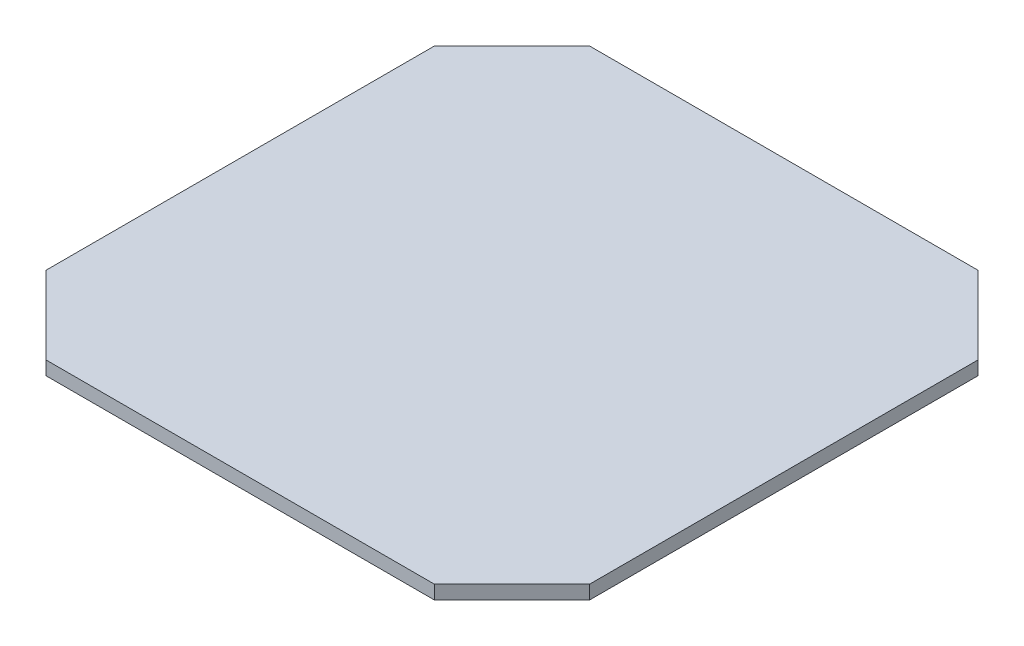
ISO-10303-21;
HEADER;
FILE_DESCRIPTION(('STEP AP214'),'2;1');
FILE_NAME('part.step','',(''),(''),'','','');
FILE_SCHEMA(('AUTOMOTIVE_DESIGN { 1 0 10303 214 1 1 1 1 }'));
ENDSEC;
DATA;
#1=APPLICATION_CONTEXT('core data for automotive mechanical design processes');
#2=APPLICATION_PROTOCOL_DEFINITION('international standard','automotive_design',2000,#1);
#3=PRODUCT_CONTEXT('',#1,'mechanical');
#4=PRODUCT('Part','Part','',(#3));
#5=PRODUCT_RELATED_PRODUCT_CATEGORY('part','',(#4));
#6=PRODUCT_DEFINITION_FORMATION('','',#4);
#7=PRODUCT_DEFINITION_CONTEXT('part definition',#1,'design');
#8=PRODUCT_DEFINITION('design','',#6,#7);
#9=PRODUCT_DEFINITION_SHAPE('','',#8);
#10=(LENGTH_UNIT() NAMED_UNIT(*) SI_UNIT(.MILLI.,.METRE.));
#11=(NAMED_UNIT(*) PLANE_ANGLE_UNIT() SI_UNIT($,.RADIAN.));
#12=(NAMED_UNIT(*) SI_UNIT($,.STERADIAN.) SOLID_ANGLE_UNIT());
#13=UNCERTAINTY_MEASURE_WITH_UNIT(LENGTH_MEASURE(1.E-05),#10,'distance_accuracy_value','');
#14=(GEOMETRIC_REPRESENTATION_CONTEXT(3) GLOBAL_UNCERTAINTY_ASSIGNED_CONTEXT((#13)) GLOBAL_UNIT_ASSIGNED_CONTEXT((#10,
#11,#12)) REPRESENTATION_CONTEXT('',''));
#15=CARTESIAN_POINT('',(0.,0.,0.));
#16=DIRECTION('',(0.,0.,1.));
#17=DIRECTION('',(1.,0.,0.));
#18=AXIS2_PLACEMENT_3D('',#15,#16,#17);
#19=CARTESIAN_POINT('',(-62.8617928474846,3.175,44.9012806053457));
#20=DIRECTION('',(1.,0.,0.));
#21=DIRECTION('',(0.,0.,-1.));
#22=AXIS2_PLACEMENT_3D('',#19,#20,#21);
#23=PLANE('',#22);
#24=DIRECTION('',(0.,0.,1.));
#25=VECTOR('',#24,1.);
#26=CARTESIAN_POINT('',(-62.8617928474846,0.,44.9012806053457));
#27=LINE('',#26,#25);
#28=CARTESIAN_POINT('',(-62.8617928474846,0.,-44.9012806053459));
#29=VERTEX_POINT('',#28);
#30=CARTESIAN_POINT('',(-62.8617928474846,0.,44.9012806053457));
#31=VERTEX_POINT('',#30);
#32=EDGE_CURVE('E129',#29,#31,#27,.T.);
#33=ORIENTED_EDGE('',*,*,#32,.T.);
#34=DIRECTION('',(0.,-1.,0.));
#35=VECTOR('',#34,1.);
#36=CARTESIAN_POINT('',(-62.8617928474846,3.175,44.9012806053457));
#37=LINE('',#36,#35);
#38=CARTESIAN_POINT('',(-62.8617928474846,3.175,44.9012806053457));
#39=VERTEX_POINT('',#38);
#40=EDGE_CURVE('E11',#39,#31,#37,.T.);
#41=ORIENTED_EDGE('',*,*,#40,.F.);
#42=DIRECTION('',(0.,0.,1.));
#43=VECTOR('',#42,1.);
#44=CARTESIAN_POINT('',(-62.8617928474846,3.175,44.9012806053457));
#45=LINE('',#44,#43);
#46=CARTESIAN_POINT('',(-62.8617928474846,3.175,-44.9012806053459));
#47=VERTEX_POINT('',#46);
#48=EDGE_CURVE('E143',#47,#39,#45,.T.);
#49=ORIENTED_EDGE('',*,*,#48,.F.);
#50=DIRECTION('',(0.,-1.,0.));
#51=VECTOR('',#50,1.);
#52=CARTESIAN_POINT('',(-62.8617928474846,3.175,-44.9012806053459));
#53=LINE('',#52,#51);
#54=EDGE_CURVE('E125',#47,#29,#53,.T.);
#55=ORIENTED_EDGE('',*,*,#54,.T.);
#56=EDGE_LOOP('',(#33,#41,#49,#55));
#57=FACE_BOUND('',#56,.T.);
#58=ADVANCED_FACE('F33',(#57),#23,.F.);
#59=CARTESIAN_POINT('',(-62.8617928474846,3.175,44.9012806053457));
#60=DIRECTION('',(0.707106781186551,0.,-0.707106781186544));
#61=DIRECTION('',(-0.707106781186544,0.,-0.707106781186551));
#62=AXIS2_PLACEMENT_3D('',#59,#60,#61);
#63=PLANE('',#62);
#64=DIRECTION('',(0.707106781186544,0.,0.707106781186551));
#65=VECTOR('',#64,1.);
#66=CARTESIAN_POINT('',(-62.8617928474846,0.,44.9012806053457));
#67=LINE('',#66,#65);
#68=CARTESIAN_POINT('',(-44.9012806053463,0.,62.8617928474841));
#69=VERTEX_POINT('',#68);
#70=EDGE_CURVE('E132',#31,#69,#67,.T.);
#71=ORIENTED_EDGE('',*,*,#70,.T.);
#72=DIRECTION('',(0.,-1.,0.));
#73=VECTOR('',#72,1.);
#74=CARTESIAN_POINT('',(-44.9012806053463,3.175,62.8617928474841));
#75=LINE('',#74,#73);
#76=CARTESIAN_POINT('',(-44.9012806053463,3.175,62.8617928474841));
#77=VERTEX_POINT('',#76);
#78=EDGE_CURVE('E41',#77,#69,#75,.T.);
#79=ORIENTED_EDGE('',*,*,#78,.F.);
#80=DIRECTION('',(0.707106781186544,0.,0.707106781186551));
#81=VECTOR('',#80,1.);
#82=CARTESIAN_POINT('',(-62.8617928474846,3.175,44.9012806053457));
#83=LINE('',#82,#81);
#84=EDGE_CURVE('E92',#39,#77,#83,.T.);
#85=ORIENTED_EDGE('',*,*,#84,.F.);
#86=ORIENTED_EDGE('',*,*,#40,.T.);
#87=EDGE_LOOP('',(#71,#79,#85,#86));
#88=FACE_BOUND('',#87,.T.);
#89=ADVANCED_FACE('F178',(#88),#63,.F.);
#90=CARTESIAN_POINT('',(-44.9012806053463,3.175,62.8617928474841));
#91=DIRECTION('',(0.,0.,-1.));
#92=DIRECTION('',(-1.,0.,0.));
#93=AXIS2_PLACEMENT_3D('',#90,#91,#92);
#94=PLANE('',#93);
#95=DIRECTION('',(1.,0.,0.));
#96=VECTOR('',#95,1.);
#97=CARTESIAN_POINT('',(-44.9012806053463,0.,62.8617928474841));
#98=LINE('',#97,#96);
#99=CARTESIAN_POINT('',(44.9012806053452,0.,62.8617928474841));
#100=VERTEX_POINT('',#99);
#101=EDGE_CURVE('E134',#69,#100,#98,.T.);
#102=ORIENTED_EDGE('',*,*,#101,.T.);
#103=DIRECTION('',(0.,-1.,0.));
#104=VECTOR('',#103,1.);
#105=CARTESIAN_POINT('',(44.9012806053452,3.175,62.8617928474841));
#106=LINE('',#105,#104);
#107=CARTESIAN_POINT('',(44.9012806053452,3.175,62.8617928474841));
#108=VERTEX_POINT('',#107);
#109=EDGE_CURVE('E150',#108,#100,#106,.T.);
#110=ORIENTED_EDGE('',*,*,#109,.F.);
#111=DIRECTION('',(1.,0.,0.));
#112=VECTOR('',#111,1.);
#113=CARTESIAN_POINT('',(-44.9012806053463,3.175,62.8617928474841));
#114=LINE('',#113,#112);
#115=EDGE_CURVE('E158',#77,#108,#114,.T.);
#116=ORIENTED_EDGE('',*,*,#115,.F.);
#117=ORIENTED_EDGE('',*,*,#78,.T.);
#118=EDGE_LOOP('',(#102,#110,#116,#117));
#119=FACE_BOUND('',#118,.T.);
#120=ADVANCED_FACE('F156',(#119),#94,.F.);
#121=CARTESIAN_POINT('',(44.9012806053452,3.175,62.8617928474841));
#122=DIRECTION('',(-0.707106781186543,0.,-0.707106781186551));
#123=DIRECTION('',(-0.707106781186551,0.,0.707106781186544));
#124=AXIS2_PLACEMENT_3D('',#121,#122,#123);
#125=PLANE('',#124);
#126=DIRECTION('',(0.707106781186552,0.,-0.707106781186544));
#127=VECTOR('',#126,1.);
#128=CARTESIAN_POINT('',(44.9012806053452,0.,62.8617928474841));
#129=LINE('',#128,#127);
#130=CARTESIAN_POINT('',(62.8617928474836,0.,44.9012806053459));
#131=VERTEX_POINT('',#130);
#132=EDGE_CURVE('E136',#100,#131,#129,.T.);
#133=ORIENTED_EDGE('',*,*,#132,.T.);
#134=DIRECTION('',(0.,-1.,0.));
#135=VECTOR('',#134,1.);
#136=CARTESIAN_POINT('',(62.8617928474836,3.175,44.9012806053459));
#137=LINE('',#136,#135);
#138=CARTESIAN_POINT('',(62.8617928474836,3.175,44.9012806053459));
#139=VERTEX_POINT('',#138);
#140=EDGE_CURVE('E147',#139,#131,#137,.T.);
#141=ORIENTED_EDGE('',*,*,#140,.F.);
#142=DIRECTION('',(0.707106781186552,0.,-0.707106781186544));
#143=VECTOR('',#142,1.);
#144=CARTESIAN_POINT('',(44.9012806053452,3.175,62.8617928474841));
#145=LINE('',#144,#143);
#146=EDGE_CURVE('E170',#108,#139,#145,.T.);
#147=ORIENTED_EDGE('',*,*,#146,.F.);
#148=ORIENTED_EDGE('',*,*,#109,.T.);
#149=EDGE_LOOP('',(#133,#141,#147,#148));
#150=FACE_BOUND('',#149,.T.);
#151=ADVANCED_FACE('F166',(#150),#125,.F.);
#152=CARTESIAN_POINT('',(62.8617928474836,3.175,44.9012806053459));
#153=DIRECTION('',(-1.,0.,0.));
#154=DIRECTION('',(0.,0.,1.));
#155=AXIS2_PLACEMENT_3D('',#152,#153,#154);
#156=PLANE('',#155);
#157=DIRECTION('',(0.,0.,-1.));
#158=VECTOR('',#157,1.);
#159=CARTESIAN_POINT('',(62.8617928474836,0.,44.9012806053459));
#160=LINE('',#159,#158);
#161=CARTESIAN_POINT('',(62.8617928474836,0.,-44.9012806053457));
#162=VERTEX_POINT('',#161);
#163=EDGE_CURVE('E138',#131,#162,#160,.T.);
#164=ORIENTED_EDGE('',*,*,#163,.T.);
#165=DIRECTION('',(0.,-1.,0.));
#166=VECTOR('',#165,1.);
#167=CARTESIAN_POINT('',(62.8617928474836,3.175,-44.9012806053457));
#168=LINE('',#167,#166);
#169=CARTESIAN_POINT('',(62.8617928474836,3.175,-44.9012806053457));
#170=VERTEX_POINT('',#169);
#171=EDGE_CURVE('E120',#170,#162,#168,.T.);
#172=ORIENTED_EDGE('',*,*,#171,.F.);
#173=DIRECTION('',(0.,0.,-1.));
#174=VECTOR('',#173,1.);
#175=CARTESIAN_POINT('',(62.8617928474836,3.175,44.9012806053459));
#176=LINE('',#175,#174);
#177=EDGE_CURVE('E111',#139,#170,#176,.T.);
#178=ORIENTED_EDGE('',*,*,#177,.F.);
#179=ORIENTED_EDGE('',*,*,#140,.T.);
#180=EDGE_LOOP('',(#164,#172,#178,#179));
#181=FACE_BOUND('',#180,.T.);
#182=ADVANCED_FACE('F169',(#181),#156,.F.);
#183=CARTESIAN_POINT('',(62.8617928474836,3.175,-44.9012806053457));
#184=DIRECTION('',(-0.707106781186551,0.,0.707106781186544));
#185=DIRECTION('',(0.707106781186544,0.,0.707106781186551));
#186=AXIS2_PLACEMENT_3D('',#183,#184,#185);
#187=PLANE('',#186);
#188=DIRECTION('',(-0.707106781186544,0.,-0.707106781186551));
#189=VECTOR('',#188,1.);
#190=CARTESIAN_POINT('',(62.8617928474836,0.,-44.9012806053457));
#191=LINE('',#190,#189);
#192=CARTESIAN_POINT('',(44.9012806053454,0.,-62.8617928474841));
#193=VERTEX_POINT('',#192);
#194=EDGE_CURVE('E119',#162,#193,#191,.T.);
#195=ORIENTED_EDGE('',*,*,#194,.T.);
#196=DIRECTION('',(0.,-1.,0.));
#197=VECTOR('',#196,1.);
#198=CARTESIAN_POINT('',(44.9012806053454,3.175,-62.8617928474841));
#199=LINE('',#198,#197);
#200=CARTESIAN_POINT('',(44.9012806053454,3.175,-62.8617928474841));
#201=VERTEX_POINT('',#200);
#202=EDGE_CURVE('E116',#201,#193,#199,.T.);
#203=ORIENTED_EDGE('',*,*,#202,.F.);
#204=DIRECTION('',(-0.707106781186544,0.,-0.707106781186551));
#205=VECTOR('',#204,1.);
#206=CARTESIAN_POINT('',(62.8617928474836,3.175,-44.9012806053457));
#207=LINE('',#206,#205);
#208=EDGE_CURVE('E105',#170,#201,#207,.T.);
#209=ORIENTED_EDGE('',*,*,#208,.F.);
#210=ORIENTED_EDGE('',*,*,#171,.T.);
#211=EDGE_LOOP('',(#195,#203,#209,#210));
#212=FACE_BOUND('',#211,.T.);
#213=ADVANCED_FACE('F117',(#212),#187,.F.);
#214=CARTESIAN_POINT('',(-44.9012806053462,3.175,-62.8617928474841));
#215=DIRECTION('',(0.,0.,1.));
#216=DIRECTION('',(1.,0.,0.));
#217=AXIS2_PLACEMENT_3D('',#214,#215,#216);
#218=PLANE('',#217);
#219=DIRECTION('',(-1.,0.,0.));
#220=VECTOR('',#219,1.);
#221=CARTESIAN_POINT('',(-44.9012806053462,0.,-62.8617928474841));
#222=LINE('',#221,#220);
#223=CARTESIAN_POINT('',(-44.9012806053462,0.,-62.8617928474841));
#224=VERTEX_POINT('',#223);
#225=EDGE_CURVE('E78',#193,#224,#222,.T.);
#226=ORIENTED_EDGE('',*,*,#225,.T.);
#227=DIRECTION('',(0.,-1.,0.));
#228=VECTOR('',#227,1.);
#229=CARTESIAN_POINT('',(-44.9012806053462,3.175,-62.8617928474841));
#230=LINE('',#229,#228);
#231=CARTESIAN_POINT('',(-44.9012806053462,3.175,-62.8617928474841));
#232=VERTEX_POINT('',#231);
#233=EDGE_CURVE('E121',#232,#224,#230,.T.);
#234=ORIENTED_EDGE('',*,*,#233,.F.);
#235=DIRECTION('',(-1.,0.,0.));
#236=VECTOR('',#235,1.);
#237=CARTESIAN_POINT('',(-44.9012806053462,3.175,-62.8617928474841));
#238=LINE('',#237,#236);
#239=EDGE_CURVE('E109',#201,#232,#238,.T.);
#240=ORIENTED_EDGE('',*,*,#239,.F.);
#241=ORIENTED_EDGE('',*,*,#202,.T.);
#242=EDGE_LOOP('',(#226,#234,#240,#241));
#243=FACE_BOUND('',#242,.T.);
#244=ADVANCED_FACE('F123',(#243),#218,.F.);
#245=CARTESIAN_POINT('',(-44.9012806053462,3.175,-62.8617928474841));
#246=DIRECTION('',(0.707106781186544,0.,0.707106781186551));
#247=DIRECTION('',(0.707106781186551,0.,-0.707106781186544));
#248=AXIS2_PLACEMENT_3D('',#245,#246,#247);
#249=PLANE('',#248);
#250=DIRECTION('',(-0.707106781186551,0.,0.707106781186544));
#251=VECTOR('',#250,1.);
#252=CARTESIAN_POINT('',(-44.9012806053462,0.,-62.8617928474841));
#253=LINE('',#252,#251);
#254=EDGE_CURVE('E84',#224,#29,#253,.T.);
#255=ORIENTED_EDGE('',*,*,#254,.T.);
#256=ORIENTED_EDGE('',*,*,#54,.F.);
#257=DIRECTION('',(-0.707106781186551,0.,0.707106781186544));
#258=VECTOR('',#257,1.);
#259=CARTESIAN_POINT('',(-44.9012806053462,3.175,-62.8617928474841));
#260=LINE('',#259,#258);
#261=EDGE_CURVE('E49',#232,#47,#260,.T.);
#262=ORIENTED_EDGE('',*,*,#261,.F.);
#263=ORIENTED_EDGE('',*,*,#233,.T.);
#264=EDGE_LOOP('',(#255,#256,#262,#263));
#265=FACE_BOUND('',#264,.T.);
#266=ADVANCED_FACE('F194',(#265),#249,.F.);
#267=CARTESIAN_POINT('',(0.,3.175,0.));
#268=DIRECTION('',(0.,-1.,0.));
#269=DIRECTION('',(0.,0.,-1.));
#270=AXIS2_PLACEMENT_3D('',#267,#268,#269);
#271=PLANE('',#270);
#272=ORIENTED_EDGE('',*,*,#48,.T.);
#273=ORIENTED_EDGE('',*,*,#84,.T.);
#274=ORIENTED_EDGE('',*,*,#115,.T.);
#275=ORIENTED_EDGE('',*,*,#146,.T.);
#276=ORIENTED_EDGE('',*,*,#177,.T.);
#277=ORIENTED_EDGE('',*,*,#208,.T.);
#278=ORIENTED_EDGE('',*,*,#239,.T.);
#279=ORIENTED_EDGE('',*,*,#261,.T.);
#280=EDGE_LOOP('',(#272,#273,#274,#275,#276,#277,#278,#279));
#281=FACE_BOUND('',#280,.T.);
#282=ADVANCED_FACE('F107',(#281),#271,.F.);
#283=CARTESIAN_POINT('',(0.,0.,0.));
#284=DIRECTION('',(0.,-1.,0.));
#285=DIRECTION('',(0.,0.,-1.));
#286=AXIS2_PLACEMENT_3D('',#283,#284,#285);
#287=PLANE('',#286);
#288=ORIENTED_EDGE('',*,*,#32,.F.);
#289=ORIENTED_EDGE('',*,*,#254,.F.);
#290=ORIENTED_EDGE('',*,*,#225,.F.);
#291=ORIENTED_EDGE('',*,*,#194,.F.);
#292=ORIENTED_EDGE('',*,*,#163,.F.);
#293=ORIENTED_EDGE('',*,*,#132,.F.);
#294=ORIENTED_EDGE('',*,*,#101,.F.);
#295=ORIENTED_EDGE('',*,*,#70,.F.);
#296=EDGE_LOOP('',(#288,#289,#290,#291,#292,#293,#294,#295));
#297=FACE_BOUND('',#296,.T.);
#298=ADVANCED_FACE('F162',(#297),#287,.T.);
#299=CLOSED_SHELL('',(#58,#89,#120,#151,#182,#213,#244,#266,#282,#298));
#300=MANIFOLD_SOLID_BREP('B2',#299);
#301=ADVANCED_BREP_SHAPE_REPRESENTATION('',(#18,#300),#14);
#302=SHAPE_DEFINITION_REPRESENTATION(#9,#301);
ENDSEC;
END-ISO-10303-21;
